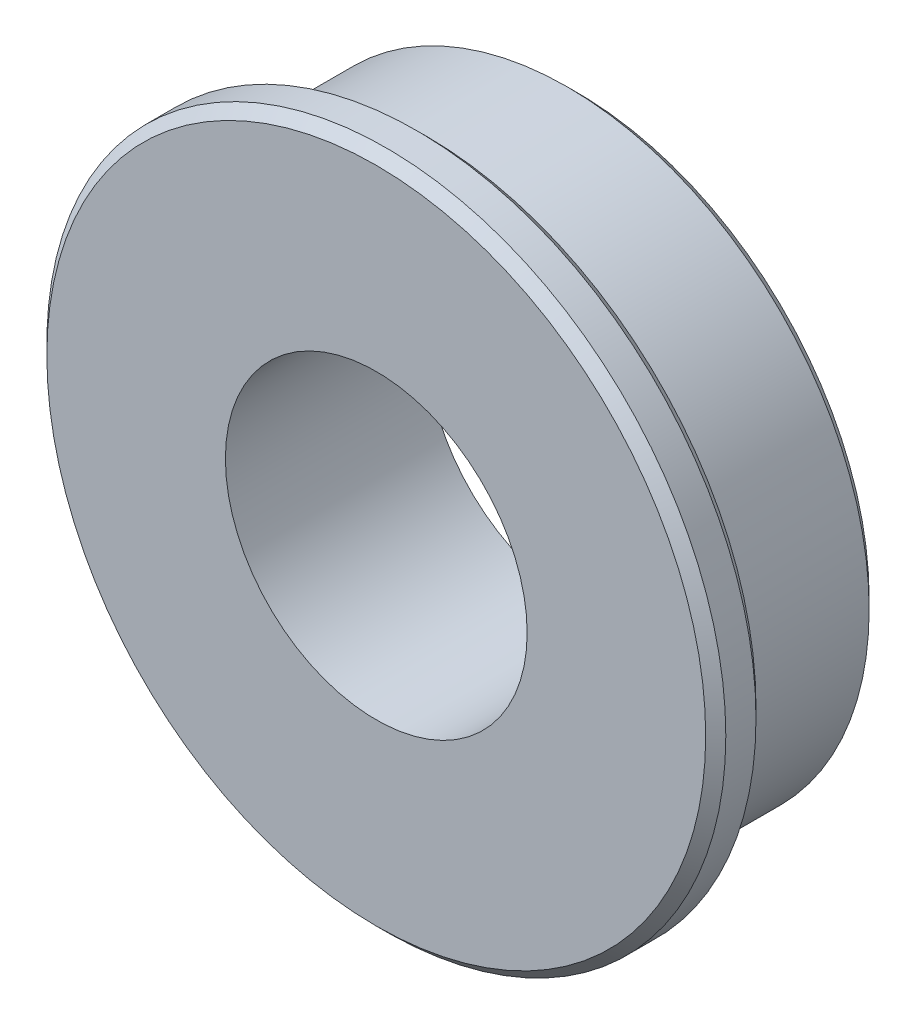
ISO-10303-21;
HEADER;
FILE_DESCRIPTION(('STEP AP214'),'2;1');
FILE_NAME('part.step','',(''),(''),'','','');
FILE_SCHEMA(('AUTOMOTIVE_DESIGN { 1 0 10303 214 1 1 1 1 }'));
ENDSEC;
DATA;
#1=APPLICATION_CONTEXT('core data for automotive mechanical design processes');
#2=APPLICATION_PROTOCOL_DEFINITION('international standard','automotive_design',2000,#1);
#3=PRODUCT_CONTEXT('',#1,'mechanical');
#4=PRODUCT('Part','Part','',(#3));
#5=PRODUCT_RELATED_PRODUCT_CATEGORY('part','',(#4));
#6=PRODUCT_DEFINITION_FORMATION('','',#4);
#7=PRODUCT_DEFINITION_CONTEXT('part definition',#1,'design');
#8=PRODUCT_DEFINITION('design','',#6,#7);
#9=PRODUCT_DEFINITION_SHAPE('','',#8);
#10=(LENGTH_UNIT() NAMED_UNIT(*) SI_UNIT(.MILLI.,.METRE.));
#11=(NAMED_UNIT(*) PLANE_ANGLE_UNIT() SI_UNIT($,.RADIAN.));
#12=(NAMED_UNIT(*) SI_UNIT($,.STERADIAN.) SOLID_ANGLE_UNIT());
#13=UNCERTAINTY_MEASURE_WITH_UNIT(LENGTH_MEASURE(1.E-05),#10,'distance_accuracy_value','');
#14=(GEOMETRIC_REPRESENTATION_CONTEXT(3) GLOBAL_UNCERTAINTY_ASSIGNED_CONTEXT((#13)) GLOBAL_UNIT_ASSIGNED_CONTEXT((#10,
#11,#12)) REPRESENTATION_CONTEXT('',''));
#15=CARTESIAN_POINT('',(0.,0.,0.));
#16=DIRECTION('',(0.,0.,1.));
#17=DIRECTION('',(1.,0.,0.));
#18=AXIS2_PLACEMENT_3D('',#15,#16,#17);
#19=CARTESIAN_POINT('',(0.,0.,2.));
#20=DIRECTION('',(0.,0.,-1.));
#21=DIRECTION('',(-1.,0.,0.));
#22=AXIS2_PLACEMENT_3D('',#19,#20,#21);
#23=CYLINDRICAL_SURFACE('',#22,6.);
#24=CARTESIAN_POINT('',(0.,0.,-1.8));
#25=DIRECTION('',(0.,0.,1.));
#26=DIRECTION('',(1.,0.,0.));
#27=AXIS2_PLACEMENT_3D('',#24,#25,#26);
#28=CIRCLE('',#27,6.);
#29=CARTESIAN_POINT('',(6.,0.,-1.8));
#30=VERTEX_POINT('',#29);
#31=EDGE_CURVE('E57',#30,#30,#28,.T.);
#32=ORIENTED_EDGE('',*,*,#31,.T.);
#33=EDGE_LOOP('',(#32));
#34=FACE_BOUND('',#33,.T.);
#35=CARTESIAN_POINT('',(0.,0.,1.));
#36=DIRECTION('',(0.,0.,1.));
#37=DIRECTION('',(1.,0.,0.));
#38=AXIS2_PLACEMENT_3D('',#35,#36,#37);
#39=CIRCLE('',#38,6.);
#40=CARTESIAN_POINT('',(6.,0.,1.));
#41=VERTEX_POINT('',#40);
#42=EDGE_CURVE('E60',#41,#41,#39,.T.);
#43=ORIENTED_EDGE('',*,*,#42,.F.);
#44=EDGE_LOOP('',(#43));
#45=FACE_BOUND('',#44,.T.);
#46=ADVANCED_FACE('F33',(#34,#45),#23,.T.);
#47=CARTESIAN_POINT('',(0.,0.,2.));
#48=DIRECTION('',(0.,0.,1.));
#49=DIRECTION('',(1.,0.,0.));
#50=AXIS2_PLACEMENT_3D('',#47,#48,#49);
#51=PLANE('',#50);
#52=CARTESIAN_POINT('',(0.,0.,2.));
#53=DIRECTION('',(0.,0.,1.));
#54=DIRECTION('',(1.,0.,0.));
#55=AXIS2_PLACEMENT_3D('',#52,#53,#54);
#56=CIRCLE('',#55,6.55);
#57=CARTESIAN_POINT('',(6.55,0.,2.));
#58=VERTEX_POINT('',#57);
#59=EDGE_CURVE('E10',#58,#58,#56,.T.);
#60=ORIENTED_EDGE('',*,*,#59,.T.);
#61=EDGE_LOOP('',(#60));
#62=FACE_BOUND('',#61,.T.);
#63=CARTESIAN_POINT('',(0.,0.,2.));
#64=DIRECTION('',(0.,0.,1.));
#65=DIRECTION('',(1.,0.,0.));
#66=AXIS2_PLACEMENT_3D('',#63,#64,#65);
#67=CIRCLE('',#66,3.);
#68=CARTESIAN_POINT('',(3.,0.,2.));
#69=VERTEX_POINT('',#68);
#70=EDGE_CURVE('E64',#69,#69,#67,.T.);
#71=ORIENTED_EDGE('',*,*,#70,.F.);
#72=EDGE_LOOP('',(#71));
#73=FACE_BOUND('',#72,.T.);
#74=ADVANCED_FACE('F73',(#62,#73),#51,.T.);
#75=CARTESIAN_POINT('',(0.,0.,-2.));
#76=DIRECTION('',(0.,0.,1.));
#77=DIRECTION('',(1.,0.,0.));
#78=AXIS2_PLACEMENT_3D('',#75,#76,#77);
#79=PLANE('',#78);
#80=CARTESIAN_POINT('',(0.,0.,-2.));
#81=DIRECTION('',(0.,0.,1.));
#82=DIRECTION('',(1.,0.,0.));
#83=AXIS2_PLACEMENT_3D('',#80,#81,#82);
#84=CIRCLE('',#83,5.8);
#85=CARTESIAN_POINT('',(5.8,0.,-2.));
#86=VERTEX_POINT('',#85);
#87=EDGE_CURVE('E54',#86,#86,#84,.F.);
#88=ORIENTED_EDGE('',*,*,#87,.T.);
#89=EDGE_LOOP('',(#88));
#90=FACE_BOUND('',#89,.T.);
#91=CARTESIAN_POINT('',(0.,0.,-2.));
#92=DIRECTION('',(0.,0.,1.));
#93=DIRECTION('',(1.,0.,0.));
#94=AXIS2_PLACEMENT_3D('',#91,#92,#93);
#95=CIRCLE('',#94,3.);
#96=CARTESIAN_POINT('',(3.,0.,-2.));
#97=VERTEX_POINT('',#96);
#98=EDGE_CURVE('E61',#97,#97,#95,.T.);
#99=ORIENTED_EDGE('',*,*,#98,.T.);
#100=EDGE_LOOP('',(#99));
#101=FACE_BOUND('',#100,.T.);
#102=ADVANCED_FACE('F79',(#90,#101),#79,.F.);
#103=CARTESIAN_POINT('',(0.,0.,2.));
#104=DIRECTION('',(0.,0.,-1.));
#105=DIRECTION('',(-1.,0.,0.));
#106=AXIS2_PLACEMENT_3D('',#103,#104,#105);
#107=CYLINDRICAL_SURFACE('',#106,3.);
#108=ORIENTED_EDGE('',*,*,#70,.T.);
#109=EDGE_LOOP('',(#108));
#110=FACE_BOUND('',#109,.T.);
#111=ORIENTED_EDGE('',*,*,#98,.F.);
#112=EDGE_LOOP('',(#111));
#113=FACE_BOUND('',#112,.T.);
#114=ADVANCED_FACE('F111',(#110,#113),#107,.F.);
#115=CARTESIAN_POINT('',(0.,0.,1.));
#116=DIRECTION('',(0.,0.,1.));
#117=DIRECTION('',(1.,0.,0.));
#118=AXIS2_PLACEMENT_3D('',#115,#116,#117);
#119=PLANE('',#118);
#120=CARTESIAN_POINT('',(0.,0.,1.));
#121=DIRECTION('',(0.,0.,1.));
#122=DIRECTION('',(1.,0.,0.));
#123=AXIS2_PLACEMENT_3D('',#120,#121,#122);
#124=CIRCLE('',#123,6.55);
#125=CARTESIAN_POINT('',(6.55,0.,1.));
#126=VERTEX_POINT('',#125);
#127=EDGE_CURVE('E41',#126,#126,#124,.F.);
#128=ORIENTED_EDGE('',*,*,#127,.T.);
#129=EDGE_LOOP('',(#128));
#130=FACE_BOUND('',#129,.T.);
#131=ORIENTED_EDGE('',*,*,#42,.T.);
#132=EDGE_LOOP('',(#131));
#133=FACE_BOUND('',#132,.T.);
#134=ADVANCED_FACE('F70',(#130,#133),#119,.F.);
#135=CARTESIAN_POINT('',(0.,0.,1.));
#136=DIRECTION('',(0.,0.,1.));
#137=DIRECTION('',(1.,0.,0.));
#138=AXIS2_PLACEMENT_3D('',#135,#136,#137);
#139=CYLINDRICAL_SURFACE('',#138,6.75);
#140=CARTESIAN_POINT('',(0.,0.,1.2));
#141=DIRECTION('',(0.,0.,1.));
#142=DIRECTION('',(1.,0.,0.));
#143=AXIS2_PLACEMENT_3D('',#140,#141,#142);
#144=CIRCLE('',#143,6.75);
#145=CARTESIAN_POINT('',(6.75,0.,1.2));
#146=VERTEX_POINT('',#145);
#147=EDGE_CURVE('E45',#146,#146,#144,.T.);
#148=ORIENTED_EDGE('',*,*,#147,.T.);
#149=EDGE_LOOP('',(#148));
#150=FACE_BOUND('',#149,.T.);
#151=CARTESIAN_POINT('',(0.,0.,1.8));
#152=DIRECTION('',(0.,0.,1.));
#153=DIRECTION('',(1.,0.,0.));
#154=AXIS2_PLACEMENT_3D('',#151,#152,#153);
#155=CIRCLE('',#154,6.75);
#156=CARTESIAN_POINT('',(6.75,0.,1.8));
#157=VERTEX_POINT('',#156);
#158=EDGE_CURVE('E49',#157,#157,#155,.F.);
#159=ORIENTED_EDGE('',*,*,#158,.T.);
#160=EDGE_LOOP('',(#159));
#161=FACE_BOUND('',#160,.T.);
#162=ADVANCED_FACE('F90',(#150,#161),#139,.T.);
#163=CARTESIAN_POINT('',(0.,0.,-1.8));
#164=DIRECTION('',(0.,0.,1.));
#165=DIRECTION('',(1.,0.,0.));
#166=AXIS2_PLACEMENT_3D('',#163,#164,#165);
#167=CONICAL_SURFACE('',#166,6.,0.785398163397453);
#168=ORIENTED_EDGE('',*,*,#87,.F.);
#169=EDGE_LOOP('',(#168));
#170=FACE_BOUND('',#169,.T.);
#171=ORIENTED_EDGE('',*,*,#31,.F.);
#172=EDGE_LOOP('',(#171));
#173=FACE_BOUND('',#172,.T.);
#174=ADVANCED_FACE('F84',(#170,#173),#167,.T.);
#175=CARTESIAN_POINT('',(0.,0.,1.2));
#176=DIRECTION('',(0.,0.,1.));
#177=DIRECTION('',(1.,0.,0.));
#178=AXIS2_PLACEMENT_3D('',#175,#176,#177);
#179=CONICAL_SURFACE('',#178,6.75,0.785398163397448);
#180=ORIENTED_EDGE('',*,*,#127,.F.);
#181=EDGE_LOOP('',(#180));
#182=FACE_BOUND('',#181,.T.);
#183=ORIENTED_EDGE('',*,*,#147,.F.);
#184=EDGE_LOOP('',(#183));
#185=FACE_BOUND('',#184,.T.);
#186=ADVANCED_FACE('F89',(#182,#185),#179,.T.);
#187=CARTESIAN_POINT('',(0.,0.,2.));
#188=DIRECTION('',(0.,0.,-1.));
#189=DIRECTION('',(-1.,0.,0.));
#190=AXIS2_PLACEMENT_3D('',#187,#188,#189);
#191=CONICAL_SURFACE('',#190,6.55,0.785398163397448);
#192=ORIENTED_EDGE('',*,*,#158,.F.);
#193=EDGE_LOOP('',(#192));
#194=FACE_BOUND('',#193,.T.);
#195=ORIENTED_EDGE('',*,*,#59,.F.);
#196=EDGE_LOOP('',(#195));
#197=FACE_BOUND('',#196,.T.);
#198=ADVANCED_FACE('F36',(#194,#197),#191,.T.);
#199=CLOSED_SHELL('',(#46,#74,#102,#114,#134,#162,#174,#186,#198));
#200=MANIFOLD_SOLID_BREP('B2',#199);
#201=ADVANCED_BREP_SHAPE_REPRESENTATION('',(#18,#200),#14);
#202=SHAPE_DEFINITION_REPRESENTATION(#9,#201);
ENDSEC;
END-ISO-10303-21;
